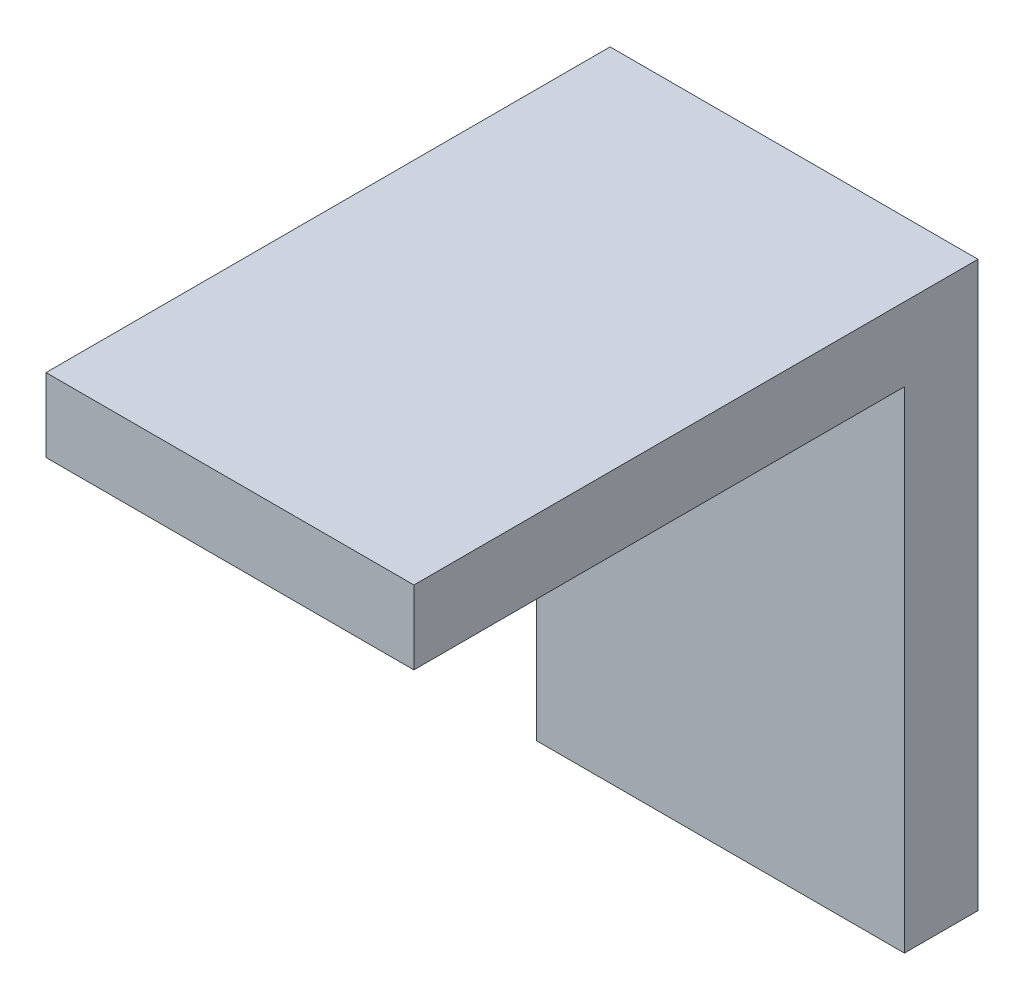
ISO-10303-21;
HEADER;
FILE_DESCRIPTION(('STEP AP214'),'2;1');
FILE_NAME('part.step','',(''),(''),'','','');
FILE_SCHEMA(('AUTOMOTIVE_DESIGN { 1 0 10303 214 1 1 1 1 }'));
ENDSEC;
DATA;
#1=APPLICATION_CONTEXT('core data for automotive mechanical design processes');
#2=APPLICATION_PROTOCOL_DEFINITION('international standard','automotive_design',2000,#1);
#3=PRODUCT_CONTEXT('',#1,'mechanical');
#4=PRODUCT('Part','Part','',(#3));
#5=PRODUCT_RELATED_PRODUCT_CATEGORY('part','',(#4));
#6=PRODUCT_DEFINITION_FORMATION('','',#4);
#7=PRODUCT_DEFINITION_CONTEXT('part definition',#1,'design');
#8=PRODUCT_DEFINITION('design','',#6,#7);
#9=PRODUCT_DEFINITION_SHAPE('','',#8);
#10=(LENGTH_UNIT() NAMED_UNIT(*) SI_UNIT(.MILLI.,.METRE.));
#11=(NAMED_UNIT(*) PLANE_ANGLE_UNIT() SI_UNIT($,.RADIAN.));
#12=(NAMED_UNIT(*) SI_UNIT($,.STERADIAN.) SOLID_ANGLE_UNIT());
#13=UNCERTAINTY_MEASURE_WITH_UNIT(LENGTH_MEASURE(1.E-05),#10,'distance_accuracy_value','');
#14=(GEOMETRIC_REPRESENTATION_CONTEXT(3) GLOBAL_UNCERTAINTY_ASSIGNED_CONTEXT((#13)) GLOBAL_UNIT_ASSIGNED_CONTEXT((#10,
#11,#12)) REPRESENTATION_CONTEXT('',''));
#15=CARTESIAN_POINT('',(0.,0.,0.));
#16=DIRECTION('',(0.,0.,1.));
#17=DIRECTION('',(1.,0.,0.));
#18=AXIS2_PLACEMENT_3D('',#15,#16,#17);
#19=CARTESIAN_POINT('',(30.,6.,0.));
#20=DIRECTION('',(0.,-1.,0.));
#21=DIRECTION('',(0.,0.,-1.));
#22=AXIS2_PLACEMENT_3D('',#19,#20,#21);
#23=PLANE('',#22);
#24=DIRECTION('',(0.,0.,-1.));
#25=VECTOR('',#24,1.);
#26=CARTESIAN_POINT('',(0.,6.,0.));
#27=LINE('',#26,#25);
#28=CARTESIAN_POINT('',(0.,6.,-6.));
#29=VERTEX_POINT('',#28);
#30=CARTESIAN_POINT('',(0.,6.,40.));
#31=VERTEX_POINT('',#30);
#32=EDGE_CURVE('E131',#29,#31,#27,.F.);
#33=ORIENTED_EDGE('',*,*,#32,.T.);
#34=DIRECTION('',(-1.,0.,0.));
#35=VECTOR('',#34,1.);
#36=CARTESIAN_POINT('',(30.,6.,40.));
#37=LINE('',#36,#35);
#38=CARTESIAN_POINT('',(30.,6.,40.));
#39=VERTEX_POINT('',#38);
#40=EDGE_CURVE('E11',#39,#31,#37,.T.);
#41=ORIENTED_EDGE('',*,*,#40,.F.);
#42=DIRECTION('',(0.,0.,-1.));
#43=VECTOR('',#42,1.);
#44=CARTESIAN_POINT('',(30.,6.,0.));
#45=LINE('',#44,#43);
#46=CARTESIAN_POINT('',(30.,6.,-6.));
#47=VERTEX_POINT('',#46);
#48=EDGE_CURVE('E92',#47,#39,#45,.F.);
#49=ORIENTED_EDGE('',*,*,#48,.F.);
#50=DIRECTION('',(-1.,0.,0.));
#51=VECTOR('',#50,1.);
#52=CARTESIAN_POINT('',(30.,6.,-6.));
#53=LINE('',#52,#51);
#54=EDGE_CURVE('E127',#47,#29,#53,.T.);
#55=ORIENTED_EDGE('',*,*,#54,.T.);
#56=EDGE_LOOP('',(#33,#41,#49,#55));
#57=FACE_BOUND('',#56,.T.);
#58=ADVANCED_FACE('F45',(#57),#23,.F.);
#59=CARTESIAN_POINT('',(30.,0.,40.));
#60=DIRECTION('',(0.,0.,1.));
#61=DIRECTION('',(1.,0.,0.));
#62=AXIS2_PLACEMENT_3D('',#59,#60,#61);
#63=PLANE('',#62);
#64=DIRECTION('',(0.,1.,0.));
#65=VECTOR('',#64,1.);
#66=CARTESIAN_POINT('',(0.,0.,40.));
#67=LINE('',#66,#65);
#68=CARTESIAN_POINT('',(0.,0.,40.));
#69=VERTEX_POINT('',#68);
#70=EDGE_CURVE('E135',#69,#31,#67,.T.);
#71=ORIENTED_EDGE('',*,*,#70,.F.);
#72=DIRECTION('',(-1.,0.,0.));
#73=VECTOR('',#72,1.);
#74=CARTESIAN_POINT('',(30.,0.,40.));
#75=LINE('',#74,#73);
#76=CARTESIAN_POINT('',(30.,0.,40.));
#77=VERTEX_POINT('',#76);
#78=EDGE_CURVE('E54',#77,#69,#75,.T.);
#79=ORIENTED_EDGE('',*,*,#78,.F.);
#80=DIRECTION('',(0.,1.,0.));
#81=VECTOR('',#80,1.);
#82=CARTESIAN_POINT('',(30.,0.,40.));
#83=LINE('',#82,#81);
#84=EDGE_CURVE('E231',#77,#39,#83,.T.);
#85=ORIENTED_EDGE('',*,*,#84,.T.);
#86=ORIENTED_EDGE('',*,*,#40,.T.);
#87=EDGE_LOOP('',(#71,#79,#85,#86));
#88=FACE_BOUND('',#87,.T.);
#89=ADVANCED_FACE('F162',(#88),#63,.T.);
#90=CARTESIAN_POINT('',(30.,0.,0.));
#91=DIRECTION('',(0.,-1.,0.));
#92=DIRECTION('',(0.,0.,-1.));
#93=AXIS2_PLACEMENT_3D('',#90,#91,#92);
#94=PLANE('',#93);
#95=DIRECTION('',(0.,0.,1.));
#96=VECTOR('',#95,1.);
#97=CARTESIAN_POINT('',(0.,0.,0.));
#98=LINE('',#97,#96);
#99=CARTESIAN_POINT('',(0.,0.,0.));
#100=VERTEX_POINT('',#99);
#101=EDGE_CURVE('E139',#100,#69,#98,.T.);
#102=ORIENTED_EDGE('',*,*,#101,.F.);
#103=DIRECTION('',(-1.,0.,0.));
#104=VECTOR('',#103,1.);
#105=CARTESIAN_POINT('',(30.,0.,0.));
#106=LINE('',#105,#104);
#107=CARTESIAN_POINT('',(30.,0.,0.));
#108=VERTEX_POINT('',#107);
#109=EDGE_CURVE('E114',#108,#100,#106,.T.);
#110=ORIENTED_EDGE('',*,*,#109,.F.);
#111=DIRECTION('',(0.,0.,1.));
#112=VECTOR('',#111,1.);
#113=CARTESIAN_POINT('',(30.,0.,0.));
#114=LINE('',#113,#112);
#115=EDGE_CURVE('E120',#108,#77,#114,.T.);
#116=ORIENTED_EDGE('',*,*,#115,.T.);
#117=ORIENTED_EDGE('',*,*,#78,.T.);
#118=EDGE_LOOP('',(#102,#110,#116,#117));
#119=FACE_BOUND('',#118,.T.);
#120=ADVANCED_FACE('F159',(#119),#94,.T.);
#121=CARTESIAN_POINT('',(30.,0.,0.));
#122=DIRECTION('',(0.,0.,1.));
#123=DIRECTION('',(0.,-1.,0.));
#124=AXIS2_PLACEMENT_3D('',#121,#122,#123);
#125=PLANE('',#124);
#126=DIRECTION('',(0.,1.,0.));
#127=VECTOR('',#126,1.);
#128=CARTESIAN_POINT('',(0.,0.,0.));
#129=LINE('',#128,#127);
#130=CARTESIAN_POINT('',(0.,-40.,0.));
#131=VERTEX_POINT('',#130);
#132=EDGE_CURVE('E108',#131,#100,#129,.T.);
#133=ORIENTED_EDGE('',*,*,#132,.F.);
#134=DIRECTION('',(-1.,0.,0.));
#135=VECTOR('',#134,1.);
#136=CARTESIAN_POINT('',(30.,-40.,0.));
#137=LINE('',#136,#135);
#138=CARTESIAN_POINT('',(30.,-40.,0.));
#139=VERTEX_POINT('',#138);
#140=EDGE_CURVE('E103',#139,#131,#137,.T.);
#141=ORIENTED_EDGE('',*,*,#140,.F.);
#142=DIRECTION('',(0.,1.,0.));
#143=VECTOR('',#142,1.);
#144=CARTESIAN_POINT('',(30.,0.,0.));
#145=LINE('',#144,#143);
#146=EDGE_CURVE('E106',#139,#108,#145,.T.);
#147=ORIENTED_EDGE('',*,*,#146,.T.);
#148=ORIENTED_EDGE('',*,*,#109,.T.);
#149=EDGE_LOOP('',(#133,#141,#147,#148));
#150=FACE_BOUND('',#149,.T.);
#151=ADVANCED_FACE('F105',(#150),#125,.T.);
#152=CARTESIAN_POINT('',(30.,-40.,-6.00000000000001));
#153=DIRECTION('',(0.,-1.,0.));
#154=DIRECTION('',(0.,0.,-1.));
#155=AXIS2_PLACEMENT_3D('',#152,#153,#154);
#156=PLANE('',#155);
#157=DIRECTION('',(0.,0.,1.));
#158=VECTOR('',#157,1.);
#159=CARTESIAN_POINT('',(0.,-40.,-6.00000000000001));
#160=LINE('',#159,#158);
#161=CARTESIAN_POINT('',(0.,-40.,-6.00000000000001));
#162=VERTEX_POINT('',#161);
#163=EDGE_CURVE('E145',#162,#131,#160,.T.);
#164=ORIENTED_EDGE('',*,*,#163,.F.);
#165=DIRECTION('',(-1.,0.,0.));
#166=VECTOR('',#165,1.);
#167=CARTESIAN_POINT('',(30.,-40.,-6.00000000000001));
#168=LINE('',#167,#166);
#169=CARTESIAN_POINT('',(30.,-40.,-6.00000000000001));
#170=VERTEX_POINT('',#169);
#171=EDGE_CURVE('E83',#170,#162,#168,.T.);
#172=ORIENTED_EDGE('',*,*,#171,.F.);
#173=DIRECTION('',(0.,0.,1.));
#174=VECTOR('',#173,1.);
#175=CARTESIAN_POINT('',(30.,-40.,-6.00000000000001));
#176=LINE('',#175,#174);
#177=EDGE_CURVE('E118',#170,#139,#176,.T.);
#178=ORIENTED_EDGE('',*,*,#177,.T.);
#179=ORIENTED_EDGE('',*,*,#140,.T.);
#180=EDGE_LOOP('',(#164,#172,#178,#179));
#181=FACE_BOUND('',#180,.T.);
#182=ADVANCED_FACE('F123',(#181),#156,.T.);
#183=CARTESIAN_POINT('',(30.,0.,-6.));
#184=DIRECTION('',(0.,0.,1.));
#185=DIRECTION('',(0.,-1.,0.));
#186=AXIS2_PLACEMENT_3D('',#183,#184,#185);
#187=PLANE('',#186);
#188=DIRECTION('',(0.,1.,0.));
#189=VECTOR('',#188,1.);
#190=CARTESIAN_POINT('',(0.,0.,-6.));
#191=LINE('',#190,#189);
#192=EDGE_CURVE('E86',#162,#29,#191,.T.);
#193=ORIENTED_EDGE('',*,*,#192,.T.);
#194=ORIENTED_EDGE('',*,*,#54,.F.);
#195=DIRECTION('',(0.,1.,0.));
#196=VECTOR('',#195,1.);
#197=CARTESIAN_POINT('',(30.,0.,-6.));
#198=LINE('',#197,#196);
#199=EDGE_CURVE('E62',#170,#47,#198,.T.);
#200=ORIENTED_EDGE('',*,*,#199,.F.);
#201=ORIENTED_EDGE('',*,*,#171,.T.);
#202=EDGE_LOOP('',(#193,#194,#200,#201));
#203=FACE_BOUND('',#202,.T.);
#204=ADVANCED_FACE('F167',(#203),#187,.F.);
#205=CARTESIAN_POINT('',(30.,0.,0.));
#206=DIRECTION('',(1.,0.,0.));
#207=DIRECTION('',(0.,0.,-1.));
#208=AXIS2_PLACEMENT_3D('',#205,#206,#207);
#209=PLANE('',#208);
#210=ORIENTED_EDGE('',*,*,#48,.T.);
#211=ORIENTED_EDGE('',*,*,#84,.F.);
#212=ORIENTED_EDGE('',*,*,#115,.F.);
#213=ORIENTED_EDGE('',*,*,#146,.F.);
#214=ORIENTED_EDGE('',*,*,#177,.F.);
#215=ORIENTED_EDGE('',*,*,#199,.T.);
#216=EDGE_LOOP('',(#210,#211,#212,#213,#214,#215));
#217=FACE_BOUND('',#216,.T.);
#218=ADVANCED_FACE('F117',(#217),#209,.T.);
#219=CARTESIAN_POINT('',(0.,0.,0.));
#220=DIRECTION('',(1.,0.,0.));
#221=DIRECTION('',(0.,0.,-1.));
#222=AXIS2_PLACEMENT_3D('',#219,#220,#221);
#223=PLANE('',#222);
#224=ORIENTED_EDGE('',*,*,#32,.F.);
#225=ORIENTED_EDGE('',*,*,#192,.F.);
#226=ORIENTED_EDGE('',*,*,#163,.T.);
#227=ORIENTED_EDGE('',*,*,#132,.T.);
#228=ORIENTED_EDGE('',*,*,#101,.T.);
#229=ORIENTED_EDGE('',*,*,#70,.T.);
#230=EDGE_LOOP('',(#224,#225,#226,#227,#228,#229));
#231=FACE_BOUND('',#230,.T.);
#232=ADVANCED_FACE('F165',(#231),#223,.F.);
#233=CLOSED_SHELL('',(#58,#89,#120,#151,#182,#204,#218,#232));
#234=MANIFOLD_SOLID_BREP('B2',#233);
#235=ADVANCED_BREP_SHAPE_REPRESENTATION('',(#18,#234),#14);
#236=SHAPE_DEFINITION_REPRESENTATION(#9,#235);
ENDSEC;
END-ISO-10303-21;
